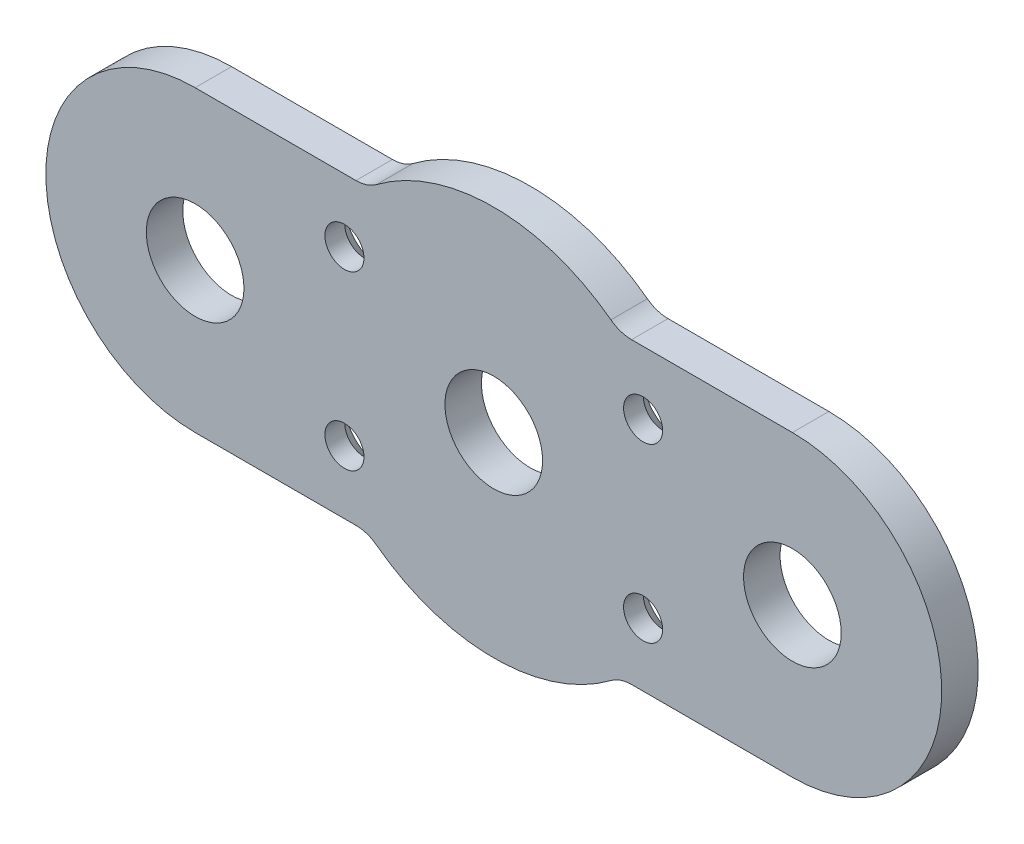
ISO-10303-21;
HEADER;
FILE_DESCRIPTION(('STEP AP214'),'2;1');
FILE_NAME('part.step','',(''),(''),'','','');
FILE_SCHEMA(('AUTOMOTIVE_DESIGN { 1 0 10303 214 1 1 1 1 }'));
ENDSEC;
DATA;
#1=APPLICATION_CONTEXT('core data for automotive mechanical design processes');
#2=APPLICATION_PROTOCOL_DEFINITION('international standard','automotive_design',2000,#1);
#3=PRODUCT_CONTEXT('',#1,'mechanical');
#4=PRODUCT('Part','Part','',(#3));
#5=PRODUCT_RELATED_PRODUCT_CATEGORY('part','',(#4));
#6=PRODUCT_DEFINITION_FORMATION('','',#4);
#7=PRODUCT_DEFINITION_CONTEXT('part definition',#1,'design');
#8=PRODUCT_DEFINITION('design','',#6,#7);
#9=PRODUCT_DEFINITION_SHAPE('','',#8);
#10=(LENGTH_UNIT() NAMED_UNIT(*) SI_UNIT(.MILLI.,.METRE.));
#11=(NAMED_UNIT(*) PLANE_ANGLE_UNIT() SI_UNIT($,.RADIAN.));
#12=(NAMED_UNIT(*) SI_UNIT($,.STERADIAN.) SOLID_ANGLE_UNIT());
#13=UNCERTAINTY_MEASURE_WITH_UNIT(LENGTH_MEASURE(1.E-05),#10,'distance_accuracy_value','');
#14=(GEOMETRIC_REPRESENTATION_CONTEXT(3) GLOBAL_UNCERTAINTY_ASSIGNED_CONTEXT((#13)) GLOBAL_UNIT_ASSIGNED_CONTEXT((#10,
#11,#12)) REPRESENTATION_CONTEXT('',''));
#15=CARTESIAN_POINT('',(0.,0.,0.));
#16=DIRECTION('',(0.,0.,1.));
#17=DIRECTION('',(1.,0.,0.));
#18=AXIS2_PLACEMENT_3D('',#15,#16,#17);
#19=CARTESIAN_POINT('',(13.,-7.5,79.9999999999841));
#20=DIRECTION('',(0.,0.,-1.));
#21=DIRECTION('',(-1.,0.,0.));
#22=AXIS2_PLACEMENT_3D('',#19,#20,#21);
#23=CONICAL_SURFACE('',#22,3.14999999997144,0.785398163397448);
#24=CARTESIAN_POINT('',(13.,-7.5,81.45));
#25=DIRECTION('',(0.,0.,1.));
#26=DIRECTION('',(1.,0.,0.));
#27=AXIS2_PLACEMENT_3D('',#24,#25,#26);
#28=CIRCLE('',#27,1.7);
#29=CARTESIAN_POINT('',(14.7,-7.5,81.45));
#30=VERTEX_POINT('',#29);
#31=EDGE_CURVE('E338',#30,#30,#28,.T.);
#32=ORIENTED_EDGE('',*,*,#31,.T.);
#33=EDGE_LOOP('',(#32));
#34=FACE_BOUND('',#33,.T.);
#35=CARTESIAN_POINT('',(13.,-7.5,79.9999999999673));
#36=DIRECTION('',(0.,0.,-1.));
#37=DIRECTION('',(-1.,0.,0.));
#38=AXIS2_PLACEMENT_3D('',#35,#36,#37);
#39=CIRCLE('',#38,3.14999999998827);
#40=CARTESIAN_POINT('',(9.85000000001173,-7.5,79.9999999999673));
#41=VERTEX_POINT('',#40);
#42=EDGE_CURVE('E20',#41,#41,#39,.F.);
#43=ORIENTED_EDGE('',*,*,#42,.F.);
#44=EDGE_LOOP('',(#43));
#45=FACE_BOUND('',#44,.T.);
#46=ADVANCED_FACE('F17',(#34,#45),#23,.F.);
#47=CARTESIAN_POINT('',(-13.,-7.5,79.9999999999272));
#48=DIRECTION('',(0.,0.,-1.));
#49=DIRECTION('',(-1.,0.,0.));
#50=AXIS2_PLACEMENT_3D('',#47,#48,#49);
#51=CONICAL_SURFACE('',#50,3.1499999999819,0.785398163377847);
#52=CARTESIAN_POINT('',(-13.,-7.5,81.45));
#53=DIRECTION('',(0.,0.,1.));
#54=DIRECTION('',(1.,0.,0.));
#55=AXIS2_PLACEMENT_3D('',#52,#53,#54);
#56=CIRCLE('',#55,1.7);
#57=CARTESIAN_POINT('',(-11.3,-7.5,81.45));
#58=VERTEX_POINT('',#57);
#59=EDGE_CURVE('E333',#58,#58,#56,.T.);
#60=ORIENTED_EDGE('',*,*,#59,.T.);
#61=EDGE_LOOP('',(#60));
#62=FACE_BOUND('',#61,.T.);
#63=CARTESIAN_POINT('',(-13.,-7.5,79.9999999999272));
#64=DIRECTION('',(0.,0.,-1.));
#65=DIRECTION('',(-1.,0.,0.));
#66=AXIS2_PLACEMENT_3D('',#63,#64,#65);
#67=CIRCLE('',#66,3.1499999999819);
#68=CARTESIAN_POINT('',(-16.1499999999819,-7.5,79.9999999999272));
#69=VERTEX_POINT('',#68);
#70=EDGE_CURVE('E217',#69,#69,#67,.F.);
#71=ORIENTED_EDGE('',*,*,#70,.F.);
#72=EDGE_LOOP('',(#71));
#73=FACE_BOUND('',#72,.T.);
#74=ADVANCED_FACE('F226',(#62,#73),#51,.F.);
#75=CARTESIAN_POINT('',(-13.,7.5,79.9999999999272));
#76=DIRECTION('',(0.,0.,-1.));
#77=DIRECTION('',(-1.,0.,0.));
#78=AXIS2_PLACEMENT_3D('',#75,#76,#77);
#79=CONICAL_SURFACE('',#78,3.1499999999819,0.785398163377847);
#80=CARTESIAN_POINT('',(-13.,7.5,81.45));
#81=DIRECTION('',(0.,0.,1.));
#82=DIRECTION('',(1.,0.,0.));
#83=AXIS2_PLACEMENT_3D('',#80,#81,#82);
#84=CIRCLE('',#83,1.7);
#85=CARTESIAN_POINT('',(-11.3,7.5,81.45));
#86=VERTEX_POINT('',#85);
#87=EDGE_CURVE('E329',#86,#86,#84,.T.);
#88=ORIENTED_EDGE('',*,*,#87,.T.);
#89=EDGE_LOOP('',(#88));
#90=FACE_BOUND('',#89,.T.);
#91=CARTESIAN_POINT('',(-13.,7.5,79.9999999999272));
#92=DIRECTION('',(0.,0.,-1.));
#93=DIRECTION('',(-1.,0.,0.));
#94=AXIS2_PLACEMENT_3D('',#91,#92,#93);
#95=CIRCLE('',#94,3.1499999999819);
#96=CARTESIAN_POINT('',(-16.1499999999819,7.5,79.9999999999272));
#97=VERTEX_POINT('',#96);
#98=EDGE_CURVE('E215',#97,#97,#95,.F.);
#99=ORIENTED_EDGE('',*,*,#98,.F.);
#100=EDGE_LOOP('',(#99));
#101=FACE_BOUND('',#100,.T.);
#102=ADVANCED_FACE('F232',(#90,#101),#79,.F.);
#103=CARTESIAN_POINT('',(13.,7.5,79.9999999999841));
#104=DIRECTION('',(0.,0.,-1.));
#105=DIRECTION('',(-1.,0.,0.));
#106=AXIS2_PLACEMENT_3D('',#103,#104,#105);
#107=CONICAL_SURFACE('',#106,3.14999999997144,0.785398163397448);
#108=CARTESIAN_POINT('',(13.,7.5,81.45));
#109=DIRECTION('',(0.,0.,1.));
#110=DIRECTION('',(1.,0.,0.));
#111=AXIS2_PLACEMENT_3D('',#108,#109,#110);
#112=CIRCLE('',#111,1.7);
#113=CARTESIAN_POINT('',(14.7,7.5,81.45));
#114=VERTEX_POINT('',#113);
#115=EDGE_CURVE('E197',#114,#114,#112,.T.);
#116=ORIENTED_EDGE('',*,*,#115,.T.);
#117=EDGE_LOOP('',(#116));
#118=FACE_BOUND('',#117,.T.);
#119=CARTESIAN_POINT('',(13.,7.5,79.9999999999673));
#120=DIRECTION('',(0.,0.,-1.));
#121=DIRECTION('',(-1.,0.,0.));
#122=AXIS2_PLACEMENT_3D('',#119,#120,#121);
#123=CIRCLE('',#122,3.14999999998827);
#124=CARTESIAN_POINT('',(9.85000000001173,7.5,79.9999999999673));
#125=VERTEX_POINT('',#124);
#126=EDGE_CURVE('E135',#125,#125,#123,.F.);
#127=ORIENTED_EDGE('',*,*,#126,.F.);
#128=EDGE_LOOP('',(#127));
#129=FACE_BOUND('',#128,.T.);
#130=ADVANCED_FACE('F317',(#118,#129),#107,.F.);
#131=CARTESIAN_POINT('',(0.,0.,80.));
#132=DIRECTION('',(0.,0.,-1.));
#133=DIRECTION('',(-1.,0.,0.));
#134=AXIS2_PLACEMENT_3D('',#131,#132,#133);
#135=PLANE('',#134);
#136=CARTESIAN_POINT('',(26.,0.,80.));
#137=DIRECTION('',(0.,0.,1.));
#138=DIRECTION('',(1.,0.,0.));
#139=AXIS2_PLACEMENT_3D('',#136,#137,#138);
#140=CIRCLE('',#139,4.25);
#141=CARTESIAN_POINT('',(30.25,0.,80.));
#142=VERTEX_POINT('',#141);
#143=EDGE_CURVE('E188',#142,#142,#140,.T.);
#144=ORIENTED_EDGE('',*,*,#143,.T.);
#145=EDGE_LOOP('',(#144));
#146=FACE_BOUND('',#145,.T.);
#147=CARTESIAN_POINT('',(-26.,0.,80.));
#148=DIRECTION('',(0.,0.,1.));
#149=DIRECTION('',(1.,0.,0.));
#150=AXIS2_PLACEMENT_3D('',#147,#148,#149);
#151=CIRCLE('',#150,4.25);
#152=CARTESIAN_POINT('',(-21.75,0.,80.));
#153=VERTEX_POINT('',#152);
#154=EDGE_CURVE('E191',#153,#153,#151,.T.);
#155=ORIENTED_EDGE('',*,*,#154,.T.);
#156=EDGE_LOOP('',(#155));
#157=FACE_BOUND('',#156,.T.);
#158=CARTESIAN_POINT('',(0.,0.,80.));
#159=DIRECTION('',(0.,0.,1.));
#160=DIRECTION('',(1.,0.,0.));
#161=AXIS2_PLACEMENT_3D('',#158,#159,#160);
#162=CIRCLE('',#161,4.25);
#163=CARTESIAN_POINT('',(4.25,0.,80.));
#164=VERTEX_POINT('',#163);
#165=EDGE_CURVE('E194',#164,#164,#162,.T.);
#166=ORIENTED_EDGE('',*,*,#165,.T.);
#167=EDGE_LOOP('',(#166));
#168=FACE_BOUND('',#167,.T.);
#169=ORIENTED_EDGE('',*,*,#126,.T.);
#170=EDGE_LOOP('',(#169));
#171=FACE_BOUND('',#170,.T.);
#172=ORIENTED_EDGE('',*,*,#98,.T.);
#173=EDGE_LOOP('',(#172));
#174=FACE_BOUND('',#173,.T.);
#175=ORIENTED_EDGE('',*,*,#70,.T.);
#176=EDGE_LOOP('',(#175));
#177=FACE_BOUND('',#176,.T.);
#178=ORIENTED_EDGE('',*,*,#42,.T.);
#179=EDGE_LOOP('',(#178));
#180=FACE_BOUND('',#179,.T.);
#181=CARTESIAN_POINT('',(0.,0.,80.));
#182=DIRECTION('',(0.,0.,-1.));
#183=DIRECTION('',(-1.,0.,0.));
#184=AXIS2_PLACEMENT_3D('',#181,#182,#183);
#185=CIRCLE('',#184,17.);
#186=CARTESIAN_POINT('',(-10.2,-13.6,80.));
#187=VERTEX_POINT('',#186);
#188=CARTESIAN_POINT('',(10.1999999999999,-13.6,80.));
#189=VERTEX_POINT('',#188);
#190=EDGE_CURVE('E203',#187,#189,#185,.F.);
#191=ORIENTED_EDGE('',*,*,#190,.F.);
#192=CARTESIAN_POINT('',(-12.,-16.,80.));
#193=DIRECTION('',(0.,0.,-1.));
#194=DIRECTION('',(-1.,0.,0.));
#195=AXIS2_PLACEMENT_3D('',#192,#193,#194);
#196=CIRCLE('',#195,3.);
#197=CARTESIAN_POINT('',(-12.,-13.,80.));
#198=VERTEX_POINT('',#197);
#199=EDGE_CURVE('E139',#187,#198,#196,.F.);
#200=ORIENTED_EDGE('',*,*,#199,.T.);
#201=DIRECTION('',(1.,0.,0.));
#202=VECTOR('',#201,1.);
#203=CARTESIAN_POINT('',(-12.,-13.,80.));
#204=LINE('',#203,#202);
#205=CARTESIAN_POINT('',(-26.,-13.,80.));
#206=VERTEX_POINT('',#205);
#207=EDGE_CURVE('E136',#206,#198,#204,.T.);
#208=ORIENTED_EDGE('',*,*,#207,.F.);
#209=CARTESIAN_POINT('',(-26.,0.,80.));
#210=DIRECTION('',(0.,0.,-1.));
#211=DIRECTION('',(-1.,0.,0.));
#212=AXIS2_PLACEMENT_3D('',#209,#210,#211);
#213=CIRCLE('',#212,13.);
#214=CARTESIAN_POINT('',(-26.,13.,80.));
#215=VERTEX_POINT('',#214);
#216=EDGE_CURVE('E198',#215,#206,#213,.F.);
#217=ORIENTED_EDGE('',*,*,#216,.F.);
#218=DIRECTION('',(1.,0.,0.));
#219=VECTOR('',#218,1.);
#220=CARTESIAN_POINT('',(-26.,13.,80.));
#221=LINE('',#220,#219);
#222=CARTESIAN_POINT('',(-12.,13.,80.));
#223=VERTEX_POINT('',#222);
#224=EDGE_CURVE('E103',#223,#215,#221,.F.);
#225=ORIENTED_EDGE('',*,*,#224,.F.);
#226=CARTESIAN_POINT('',(-12.,16.,80.));
#227=DIRECTION('',(0.,0.,-1.));
#228=DIRECTION('',(-1.,0.,0.));
#229=AXIS2_PLACEMENT_3D('',#226,#227,#228);
#230=CIRCLE('',#229,3.);
#231=CARTESIAN_POINT('',(-10.2,13.6,80.));
#232=VERTEX_POINT('',#231);
#233=EDGE_CURVE('E117',#223,#232,#230,.F.);
#234=ORIENTED_EDGE('',*,*,#233,.T.);
#235=CARTESIAN_POINT('',(0.,0.,80.));
#236=DIRECTION('',(0.,0.,-1.));
#237=DIRECTION('',(-1.,0.,0.));
#238=AXIS2_PLACEMENT_3D('',#235,#236,#237);
#239=CIRCLE('',#238,17.);
#240=CARTESIAN_POINT('',(10.1999999999999,13.6,80.));
#241=VERTEX_POINT('',#240);
#242=EDGE_CURVE('E108',#241,#232,#239,.F.);
#243=ORIENTED_EDGE('',*,*,#242,.F.);
#244=CARTESIAN_POINT('',(11.9999999999999,16.,80.));
#245=DIRECTION('',(0.,0.,-1.));
#246=DIRECTION('',(-1.,0.,0.));
#247=AXIS2_PLACEMENT_3D('',#244,#245,#246);
#248=CIRCLE('',#247,3.);
#249=CARTESIAN_POINT('',(11.9999999999999,13.,80.));
#250=VERTEX_POINT('',#249);
#251=EDGE_CURVE('E129',#241,#250,#248,.F.);
#252=ORIENTED_EDGE('',*,*,#251,.T.);
#253=DIRECTION('',(-1.,0.,0.));
#254=VECTOR('',#253,1.);
#255=CARTESIAN_POINT('',(11.9999999999999,13.,80.));
#256=LINE('',#255,#254);
#257=CARTESIAN_POINT('',(26.,13.,80.));
#258=VERTEX_POINT('',#257);
#259=EDGE_CURVE('E144',#258,#250,#256,.T.);
#260=ORIENTED_EDGE('',*,*,#259,.F.);
#261=CARTESIAN_POINT('',(26.,0.,80.));
#262=DIRECTION('',(0.,0.,-1.));
#263=DIRECTION('',(-1.,0.,0.));
#264=AXIS2_PLACEMENT_3D('',#261,#262,#263);
#265=CIRCLE('',#264,13.);
#266=CARTESIAN_POINT('',(26.,-13.,80.));
#267=VERTEX_POINT('',#266);
#268=EDGE_CURVE('E210',#267,#258,#265,.F.);
#269=ORIENTED_EDGE('',*,*,#268,.F.);
#270=DIRECTION('',(1.,0.,0.));
#271=VECTOR('',#270,1.);
#272=CARTESIAN_POINT('',(26.,-13.,80.));
#273=LINE('',#272,#271);
#274=CARTESIAN_POINT('',(11.9999999999999,-13.,80.));
#275=VERTEX_POINT('',#274);
#276=EDGE_CURVE('E140',#275,#267,#273,.T.);
#277=ORIENTED_EDGE('',*,*,#276,.F.);
#278=CARTESIAN_POINT('',(11.9999999999999,-16.,80.));
#279=DIRECTION('',(0.,0.,-1.));
#280=DIRECTION('',(-1.,0.,0.));
#281=AXIS2_PLACEMENT_3D('',#278,#279,#280);
#282=CIRCLE('',#281,3.);
#283=EDGE_CURVE('E206',#275,#189,#282,.F.);
#284=ORIENTED_EDGE('',*,*,#283,.T.);
#285=EDGE_LOOP('',(#191,#200,#208,#217,#225,#234,#243,#252,#260,#269,#277,#284));
#286=FACE_BOUND('',#285,.T.);
#287=ADVANCED_FACE('F119',(#146,#157,#168,#171,#174,#177,#180,#286),#135,.T.);
#288=CARTESIAN_POINT('',(-26.,13.,83.175));
#289=DIRECTION('',(0.,1.,0.));
#290=DIRECTION('',(0.,0.,1.));
#291=AXIS2_PLACEMENT_3D('',#288,#289,#290);
#292=PLANE('',#291);
#293=DIRECTION('',(-1.,0.,0.));
#294=VECTOR('',#293,1.);
#295=CARTESIAN_POINT('',(0.,13.,83.175));
#296=LINE('',#295,#294);
#297=CARTESIAN_POINT('',(-26.,13.,83.175));
#298=VERTEX_POINT('',#297);
#299=CARTESIAN_POINT('',(-12.,13.,83.175));
#300=VERTEX_POINT('',#299);
#301=EDGE_CURVE('E187',#298,#300,#296,.F.);
#302=ORIENTED_EDGE('',*,*,#301,.T.);
#303=DIRECTION('',(0.,0.,-1.));
#304=VECTOR('',#303,1.);
#305=CARTESIAN_POINT('',(-12.,13.,83.175));
#306=LINE('',#305,#304);
#307=EDGE_CURVE('E122',#300,#223,#306,.T.);
#308=ORIENTED_EDGE('',*,*,#307,.T.);
#309=ORIENTED_EDGE('',*,*,#224,.T.);
#310=DIRECTION('',(0.,0.,-1.));
#311=VECTOR('',#310,1.);
#312=CARTESIAN_POINT('',(-26.,13.,83.175));
#313=LINE('',#312,#311);
#314=EDGE_CURVE('E348',#298,#215,#313,.T.);
#315=ORIENTED_EDGE('',*,*,#314,.F.);
#316=EDGE_LOOP('',(#302,#308,#309,#315));
#317=FACE_BOUND('',#316,.T.);
#318=ADVANCED_FACE('F311',(#317),#292,.T.);
#319=CARTESIAN_POINT('',(-12.,16.,83.175));
#320=DIRECTION('',(0.,0.,-1.));
#321=DIRECTION('',(-1.,0.,0.));
#322=AXIS2_PLACEMENT_3D('',#319,#320,#321);
#323=CYLINDRICAL_SURFACE('',#322,3.);
#324=ORIENTED_EDGE('',*,*,#307,.F.);
#325=CARTESIAN_POINT('',(-12.,16.,83.175));
#326=DIRECTION('',(0.,0.,-1.));
#327=DIRECTION('',(-1.,0.,0.));
#328=AXIS2_PLACEMENT_3D('',#325,#326,#327);
#329=CIRCLE('',#328,3.);
#330=CARTESIAN_POINT('',(-10.2,13.6,83.175));
#331=VERTEX_POINT('',#330);
#332=EDGE_CURVE('E127',#300,#331,#329,.F.);
#333=ORIENTED_EDGE('',*,*,#332,.T.);
#334=DIRECTION('',(0.,0.,-1.));
#335=VECTOR('',#334,1.);
#336=CARTESIAN_POINT('',(-10.2,13.6,83.175));
#337=LINE('',#336,#335);
#338=EDGE_CURVE('E112',#232,#331,#337,.F.);
#339=ORIENTED_EDGE('',*,*,#338,.F.);
#340=ORIENTED_EDGE('',*,*,#233,.F.);
#341=EDGE_LOOP('',(#324,#333,#339,#340));
#342=FACE_BOUND('',#341,.T.);
#343=ADVANCED_FACE('F125',(#342),#323,.F.);
#344=CARTESIAN_POINT('',(0.,0.,83.175));
#345=DIRECTION('',(0.,0.,-1.));
#346=DIRECTION('',(-1.,0.,0.));
#347=AXIS2_PLACEMENT_3D('',#344,#345,#346);
#348=CYLINDRICAL_SURFACE('',#347,17.);
#349=CARTESIAN_POINT('',(0.,0.,83.175));
#350=DIRECTION('',(0.,0.,-1.));
#351=DIRECTION('',(-1.,0.,0.));
#352=AXIS2_PLACEMENT_3D('',#349,#350,#351);
#353=CIRCLE('',#352,17.);
#354=CARTESIAN_POINT('',(10.1999999999999,13.6,83.175));
#355=VERTEX_POINT('',#354);
#356=EDGE_CURVE('E184',#331,#355,#353,.T.);
#357=ORIENTED_EDGE('',*,*,#356,.T.);
#358=DIRECTION('',(0.,0.,-1.));
#359=VECTOR('',#358,1.);
#360=CARTESIAN_POINT('',(10.1999999999999,13.6,83.175));
#361=LINE('',#360,#359);
#362=EDGE_CURVE('E114',#355,#241,#361,.T.);
#363=ORIENTED_EDGE('',*,*,#362,.T.);
#364=ORIENTED_EDGE('',*,*,#242,.T.);
#365=ORIENTED_EDGE('',*,*,#338,.T.);
#366=EDGE_LOOP('',(#357,#363,#364,#365));
#367=FACE_BOUND('',#366,.T.);
#368=ADVANCED_FACE('F110',(#367),#348,.T.);
#369=CARTESIAN_POINT('',(11.9999999999999,16.,83.175));
#370=DIRECTION('',(0.,0.,-1.));
#371=DIRECTION('',(-1.,0.,0.));
#372=AXIS2_PLACEMENT_3D('',#369,#370,#371);
#373=CYLINDRICAL_SURFACE('',#372,3.);
#374=ORIENTED_EDGE('',*,*,#362,.F.);
#375=CARTESIAN_POINT('',(11.9999999999999,16.,83.175));
#376=DIRECTION('',(0.,0.,-1.));
#377=DIRECTION('',(-1.,0.,0.));
#378=AXIS2_PLACEMENT_3D('',#375,#376,#377);
#379=CIRCLE('',#378,3.);
#380=CARTESIAN_POINT('',(11.9999999999999,13.,83.175));
#381=VERTEX_POINT('',#380);
#382=EDGE_CURVE('E181',#355,#381,#379,.F.);
#383=ORIENTED_EDGE('',*,*,#382,.T.);
#384=DIRECTION('',(0.,0.,1.));
#385=VECTOR('',#384,1.);
#386=CARTESIAN_POINT('',(11.9999999999999,13.,83.175));
#387=LINE('',#386,#385);
#388=EDGE_CURVE('E145',#250,#381,#387,.T.);
#389=ORIENTED_EDGE('',*,*,#388,.F.);
#390=ORIENTED_EDGE('',*,*,#251,.F.);
#391=EDGE_LOOP('',(#374,#383,#389,#390));
#392=FACE_BOUND('',#391,.T.);
#393=ADVANCED_FACE('F302',(#392),#373,.F.);
#394=CARTESIAN_POINT('',(11.9999999999999,13.,83.175));
#395=DIRECTION('',(0.,1.,0.));
#396=DIRECTION('',(-1.,0.,0.));
#397=AXIS2_PLACEMENT_3D('',#394,#395,#396);
#398=PLANE('',#397);
#399=DIRECTION('',(-1.,0.,0.));
#400=VECTOR('',#399,1.);
#401=CARTESIAN_POINT('',(0.,13.,83.175));
#402=LINE('',#401,#400);
#403=CARTESIAN_POINT('',(26.,13.,83.175));
#404=VERTEX_POINT('',#403);
#405=EDGE_CURVE('E180',#381,#404,#402,.F.);
#406=ORIENTED_EDGE('',*,*,#405,.T.);
#407=DIRECTION('',(0.,0.,-1.));
#408=VECTOR('',#407,1.);
#409=CARTESIAN_POINT('',(26.,13.,83.175));
#410=LINE('',#409,#408);
#411=EDGE_CURVE('E143',#258,#404,#410,.F.);
#412=ORIENTED_EDGE('',*,*,#411,.F.);
#413=ORIENTED_EDGE('',*,*,#259,.T.);
#414=ORIENTED_EDGE('',*,*,#388,.T.);
#415=EDGE_LOOP('',(#406,#412,#413,#414));
#416=FACE_BOUND('',#415,.T.);
#417=ADVANCED_FACE('F298',(#416),#398,.T.);
#418=CARTESIAN_POINT('',(26.,0.,83.175));
#419=DIRECTION('',(0.,0.,-1.));
#420=DIRECTION('',(-1.,0.,0.));
#421=AXIS2_PLACEMENT_3D('',#418,#419,#420);
#422=CYLINDRICAL_SURFACE('',#421,13.);
#423=CARTESIAN_POINT('',(26.,0.,83.175));
#424=DIRECTION('',(0.,0.,-1.));
#425=DIRECTION('',(-1.,0.,0.));
#426=AXIS2_PLACEMENT_3D('',#423,#424,#425);
#427=CIRCLE('',#426,13.);
#428=CARTESIAN_POINT('',(26.,-13.,83.175));
#429=VERTEX_POINT('',#428);
#430=EDGE_CURVE('E177',#404,#429,#427,.T.);
#431=ORIENTED_EDGE('',*,*,#430,.T.);
#432=DIRECTION('',(0.,0.,-1.));
#433=VECTOR('',#432,1.);
#434=CARTESIAN_POINT('',(26.,-13.,83.175));
#435=LINE('',#434,#433);
#436=EDGE_CURVE('E142',#267,#429,#435,.F.);
#437=ORIENTED_EDGE('',*,*,#436,.F.);
#438=ORIENTED_EDGE('',*,*,#268,.T.);
#439=ORIENTED_EDGE('',*,*,#411,.T.);
#440=EDGE_LOOP('',(#431,#437,#438,#439));
#441=FACE_BOUND('',#440,.T.);
#442=ADVANCED_FACE('F294',(#441),#422,.T.);
#443=CARTESIAN_POINT('',(26.,-13.,83.175));
#444=DIRECTION('',(0.,-1.,0.));
#445=DIRECTION('',(0.,0.,-1.));
#446=AXIS2_PLACEMENT_3D('',#443,#444,#445);
#447=PLANE('',#446);
#448=DIRECTION('',(-1.,0.,0.));
#449=VECTOR('',#448,1.);
#450=CARTESIAN_POINT('',(0.,-13.,83.175));
#451=LINE('',#450,#449);
#452=CARTESIAN_POINT('',(11.9999999999999,-13.,83.175));
#453=VERTEX_POINT('',#452);
#454=EDGE_CURVE('E176',#429,#453,#451,.T.);
#455=ORIENTED_EDGE('',*,*,#454,.T.);
#456=DIRECTION('',(0.,0.,-1.));
#457=VECTOR('',#456,1.);
#458=CARTESIAN_POINT('',(11.9999999999999,-13.,83.175));
#459=LINE('',#458,#457);
#460=EDGE_CURVE('E209',#453,#275,#459,.T.);
#461=ORIENTED_EDGE('',*,*,#460,.T.);
#462=ORIENTED_EDGE('',*,*,#276,.T.);
#463=ORIENTED_EDGE('',*,*,#436,.T.);
#464=EDGE_LOOP('',(#455,#461,#462,#463));
#465=FACE_BOUND('',#464,.T.);
#466=ADVANCED_FACE('F290',(#465),#447,.T.);
#467=CARTESIAN_POINT('',(11.9999999999999,-16.,83.175));
#468=DIRECTION('',(0.,0.,-1.));
#469=DIRECTION('',(-1.,0.,0.));
#470=AXIS2_PLACEMENT_3D('',#467,#468,#469);
#471=CYLINDRICAL_SURFACE('',#470,3.);
#472=ORIENTED_EDGE('',*,*,#460,.F.);
#473=CARTESIAN_POINT('',(11.9999999999999,-16.,83.175));
#474=DIRECTION('',(0.,0.,-1.));
#475=DIRECTION('',(-1.,0.,0.));
#476=AXIS2_PLACEMENT_3D('',#473,#474,#475);
#477=CIRCLE('',#476,3.);
#478=CARTESIAN_POINT('',(10.1999999999999,-13.6,83.175));
#479=VERTEX_POINT('',#478);
#480=EDGE_CURVE('E173',#453,#479,#477,.F.);
#481=ORIENTED_EDGE('',*,*,#480,.T.);
#482=DIRECTION('',(0.,0.,-1.));
#483=VECTOR('',#482,1.);
#484=CARTESIAN_POINT('',(10.1999999999999,-13.6,83.175));
#485=LINE('',#484,#483);
#486=EDGE_CURVE('E205',#189,#479,#485,.F.);
#487=ORIENTED_EDGE('',*,*,#486,.F.);
#488=ORIENTED_EDGE('',*,*,#283,.F.);
#489=EDGE_LOOP('',(#472,#481,#487,#488));
#490=FACE_BOUND('',#489,.T.);
#491=ADVANCED_FACE('F286',(#490),#471,.F.);
#492=CARTESIAN_POINT('',(0.,0.,83.175));
#493=DIRECTION('',(0.,0.,-1.));
#494=DIRECTION('',(-1.,0.,0.));
#495=AXIS2_PLACEMENT_3D('',#492,#493,#494);
#496=CYLINDRICAL_SURFACE('',#495,17.);
#497=CARTESIAN_POINT('',(0.,0.,83.175));
#498=DIRECTION('',(0.,0.,-1.));
#499=DIRECTION('',(-1.,0.,0.));
#500=AXIS2_PLACEMENT_3D('',#497,#498,#499);
#501=CIRCLE('',#500,17.);
#502=CARTESIAN_POINT('',(-10.2,-13.6,83.175));
#503=VERTEX_POINT('',#502);
#504=EDGE_CURVE('E170',#479,#503,#501,.T.);
#505=ORIENTED_EDGE('',*,*,#504,.T.);
#506=DIRECTION('',(0.,0.,-1.));
#507=VECTOR('',#506,1.);
#508=CARTESIAN_POINT('',(-10.2,-13.6,83.175));
#509=LINE('',#508,#507);
#510=EDGE_CURVE('E202',#503,#187,#509,.T.);
#511=ORIENTED_EDGE('',*,*,#510,.T.);
#512=ORIENTED_EDGE('',*,*,#190,.T.);
#513=ORIENTED_EDGE('',*,*,#486,.T.);
#514=EDGE_LOOP('',(#505,#511,#512,#513));
#515=FACE_BOUND('',#514,.T.);
#516=ADVANCED_FACE('F282',(#515),#496,.T.);
#517=CARTESIAN_POINT('',(-12.,-16.,83.175));
#518=DIRECTION('',(0.,0.,-1.));
#519=DIRECTION('',(-1.,0.,0.));
#520=AXIS2_PLACEMENT_3D('',#517,#518,#519);
#521=CYLINDRICAL_SURFACE('',#520,3.);
#522=ORIENTED_EDGE('',*,*,#510,.F.);
#523=CARTESIAN_POINT('',(-12.,-16.,83.175));
#524=DIRECTION('',(0.,0.,-1.));
#525=DIRECTION('',(-1.,0.,0.));
#526=AXIS2_PLACEMENT_3D('',#523,#524,#525);
#527=CIRCLE('',#526,3.);
#528=CARTESIAN_POINT('',(-12.,-13.,83.175));
#529=VERTEX_POINT('',#528);
#530=EDGE_CURVE('E167',#503,#529,#527,.F.);
#531=ORIENTED_EDGE('',*,*,#530,.T.);
#532=DIRECTION('',(0.,0.,-1.));
#533=VECTOR('',#532,1.);
#534=CARTESIAN_POINT('',(-12.,-13.,83.175));
#535=LINE('',#534,#533);
#536=EDGE_CURVE('E138',#198,#529,#535,.F.);
#537=ORIENTED_EDGE('',*,*,#536,.F.);
#538=ORIENTED_EDGE('',*,*,#199,.F.);
#539=EDGE_LOOP('',(#522,#531,#537,#538));
#540=FACE_BOUND('',#539,.T.);
#541=ADVANCED_FACE('F278',(#540),#521,.F.);
#542=CARTESIAN_POINT('',(-12.,-13.,83.175));
#543=DIRECTION('',(0.,-1.,0.));
#544=DIRECTION('',(0.,0.,-1.));
#545=AXIS2_PLACEMENT_3D('',#542,#543,#544);
#546=PLANE('',#545);
#547=DIRECTION('',(-1.,0.,0.));
#548=VECTOR('',#547,1.);
#549=CARTESIAN_POINT('',(0.,-13.,83.175));
#550=LINE('',#549,#548);
#551=CARTESIAN_POINT('',(-26.,-13.,83.175));
#552=VERTEX_POINT('',#551);
#553=EDGE_CURVE('E166',#529,#552,#550,.T.);
#554=ORIENTED_EDGE('',*,*,#553,.T.);
#555=DIRECTION('',(0.,0.,-1.));
#556=VECTOR('',#555,1.);
#557=CARTESIAN_POINT('',(-26.,-13.,83.175));
#558=LINE('',#557,#556);
#559=EDGE_CURVE('E35',#206,#552,#558,.F.);
#560=ORIENTED_EDGE('',*,*,#559,.F.);
#561=ORIENTED_EDGE('',*,*,#207,.T.);
#562=ORIENTED_EDGE('',*,*,#536,.T.);
#563=EDGE_LOOP('',(#554,#560,#561,#562));
#564=FACE_BOUND('',#563,.T.);
#565=ADVANCED_FACE('F275',(#564),#546,.T.);
#566=CARTESIAN_POINT('',(-26.,0.,83.175));
#567=DIRECTION('',(0.,0.,-1.));
#568=DIRECTION('',(-1.,0.,0.));
#569=AXIS2_PLACEMENT_3D('',#566,#567,#568);
#570=CYLINDRICAL_SURFACE('',#569,13.);
#571=CARTESIAN_POINT('',(-26.,0.,83.175));
#572=DIRECTION('',(0.,0.,-1.));
#573=DIRECTION('',(-1.,0.,0.));
#574=AXIS2_PLACEMENT_3D('',#571,#572,#573);
#575=CIRCLE('',#574,13.);
#576=EDGE_CURVE('E164',#552,#298,#575,.T.);
#577=ORIENTED_EDGE('',*,*,#576,.T.);
#578=ORIENTED_EDGE('',*,*,#314,.T.);
#579=ORIENTED_EDGE('',*,*,#216,.T.);
#580=ORIENTED_EDGE('',*,*,#559,.T.);
#581=EDGE_LOOP('',(#577,#578,#579,#580));
#582=FACE_BOUND('',#581,.T.);
#583=ADVANCED_FACE('F271',(#582),#570,.T.);
#584=CARTESIAN_POINT('',(13.,-7.5,88.));
#585=DIRECTION('',(0.,0.,1.));
#586=DIRECTION('',(1.,0.,0.));
#587=AXIS2_PLACEMENT_3D('',#584,#585,#586);
#588=CYLINDRICAL_SURFACE('',#587,1.7);
#589=CARTESIAN_POINT('',(13.,-7.5,83.175));
#590=DIRECTION('',(0.,0.,1.));
#591=DIRECTION('',(1.,0.,0.));
#592=AXIS2_PLACEMENT_3D('',#589,#590,#591);
#593=CIRCLE('',#592,1.7);
#594=CARTESIAN_POINT('',(14.7,-7.5,83.175));
#595=VERTEX_POINT('',#594);
#596=EDGE_CURVE('E161',#595,#595,#593,.T.);
#597=ORIENTED_EDGE('',*,*,#596,.T.);
#598=EDGE_LOOP('',(#597));
#599=FACE_BOUND('',#598,.T.);
#600=ORIENTED_EDGE('',*,*,#31,.F.);
#601=EDGE_LOOP('',(#600));
#602=FACE_BOUND('',#601,.T.);
#603=ADVANCED_FACE('F267',(#599,#602),#588,.F.);
#604=CARTESIAN_POINT('',(-13.,-7.5,88.));
#605=DIRECTION('',(0.,0.,1.));
#606=DIRECTION('',(1.,0.,0.));
#607=AXIS2_PLACEMENT_3D('',#604,#605,#606);
#608=CYLINDRICAL_SURFACE('',#607,1.7);
#609=CARTESIAN_POINT('',(-13.,-7.5,83.175));
#610=DIRECTION('',(0.,0.,1.));
#611=DIRECTION('',(1.,0.,0.));
#612=AXIS2_PLACEMENT_3D('',#609,#610,#611);
#613=CIRCLE('',#612,1.7);
#614=CARTESIAN_POINT('',(-11.3,-7.5,83.175));
#615=VERTEX_POINT('',#614);
#616=EDGE_CURVE('E158',#615,#615,#613,.T.);
#617=ORIENTED_EDGE('',*,*,#616,.T.);
#618=EDGE_LOOP('',(#617));
#619=FACE_BOUND('',#618,.T.);
#620=ORIENTED_EDGE('',*,*,#59,.F.);
#621=EDGE_LOOP('',(#620));
#622=FACE_BOUND('',#621,.T.);
#623=ADVANCED_FACE('F263',(#619,#622),#608,.F.);
#624=CARTESIAN_POINT('',(-13.,7.5,88.));
#625=DIRECTION('',(0.,0.,1.));
#626=DIRECTION('',(1.,0.,0.));
#627=AXIS2_PLACEMENT_3D('',#624,#625,#626);
#628=CYLINDRICAL_SURFACE('',#627,1.7);
#629=CARTESIAN_POINT('',(-13.,7.5,83.175));
#630=DIRECTION('',(0.,0.,1.));
#631=DIRECTION('',(1.,0.,0.));
#632=AXIS2_PLACEMENT_3D('',#629,#630,#631);
#633=CIRCLE('',#632,1.7);
#634=CARTESIAN_POINT('',(-11.3,7.5,83.175));
#635=VERTEX_POINT('',#634);
#636=EDGE_CURVE('E155',#635,#635,#633,.T.);
#637=ORIENTED_EDGE('',*,*,#636,.T.);
#638=EDGE_LOOP('',(#637));
#639=FACE_BOUND('',#638,.T.);
#640=ORIENTED_EDGE('',*,*,#87,.F.);
#641=EDGE_LOOP('',(#640));
#642=FACE_BOUND('',#641,.T.);
#643=ADVANCED_FACE('F259',(#639,#642),#628,.F.);
#644=CARTESIAN_POINT('',(13.,7.5,88.));
#645=DIRECTION('',(0.,0.,1.));
#646=DIRECTION('',(1.,0.,0.));
#647=AXIS2_PLACEMENT_3D('',#644,#645,#646);
#648=CYLINDRICAL_SURFACE('',#647,1.7);
#649=CARTESIAN_POINT('',(13.,7.5,83.175));
#650=DIRECTION('',(0.,0.,1.));
#651=DIRECTION('',(1.,0.,0.));
#652=AXIS2_PLACEMENT_3D('',#649,#650,#651);
#653=CIRCLE('',#652,1.7);
#654=CARTESIAN_POINT('',(14.7,7.5,83.175));
#655=VERTEX_POINT('',#654);
#656=EDGE_CURVE('E152',#655,#655,#653,.T.);
#657=ORIENTED_EDGE('',*,*,#656,.T.);
#658=EDGE_LOOP('',(#657));
#659=FACE_BOUND('',#658,.T.);
#660=ORIENTED_EDGE('',*,*,#115,.F.);
#661=EDGE_LOOP('',(#660));
#662=FACE_BOUND('',#661,.T.);
#663=ADVANCED_FACE('F255',(#659,#662),#648,.F.);
#664=CARTESIAN_POINT('',(0.,0.,92.7462499999999));
#665=DIRECTION('',(0.,0.,1.));
#666=DIRECTION('',(1.,0.,0.));
#667=AXIS2_PLACEMENT_3D('',#664,#665,#666);
#668=CYLINDRICAL_SURFACE('',#667,4.25);
#669=CARTESIAN_POINT('',(0.,0.,83.175));
#670=DIRECTION('',(0.,0.,1.));
#671=DIRECTION('',(1.,0.,0.));
#672=AXIS2_PLACEMENT_3D('',#669,#670,#671);
#673=CIRCLE('',#672,4.25);
#674=CARTESIAN_POINT('',(4.25,0.,83.175));
#675=VERTEX_POINT('',#674);
#676=EDGE_CURVE('E149',#675,#675,#673,.T.);
#677=ORIENTED_EDGE('',*,*,#676,.T.);
#678=EDGE_LOOP('',(#677));
#679=FACE_BOUND('',#678,.T.);
#680=ORIENTED_EDGE('',*,*,#165,.F.);
#681=EDGE_LOOP('',(#680));
#682=FACE_BOUND('',#681,.T.);
#683=ADVANCED_FACE('F251',(#679,#682),#668,.F.);
#684=CARTESIAN_POINT('',(-26.,0.,92.7462499999999));
#685=DIRECTION('',(0.,0.,1.));
#686=DIRECTION('',(1.,0.,0.));
#687=AXIS2_PLACEMENT_3D('',#684,#685,#686);
#688=CYLINDRICAL_SURFACE('',#687,4.25);
#689=CARTESIAN_POINT('',(-26.,0.,83.175));
#690=DIRECTION('',(0.,0.,1.));
#691=DIRECTION('',(1.,0.,0.));
#692=AXIS2_PLACEMENT_3D('',#689,#690,#691);
#693=CIRCLE('',#692,4.25);
#694=CARTESIAN_POINT('',(-21.75,0.,83.175));
#695=VERTEX_POINT('',#694);
#696=EDGE_CURVE('E26',#695,#695,#693,.T.);
#697=ORIENTED_EDGE('',*,*,#696,.T.);
#698=EDGE_LOOP('',(#697));
#699=FACE_BOUND('',#698,.T.);
#700=ORIENTED_EDGE('',*,*,#154,.F.);
#701=EDGE_LOOP('',(#700));
#702=FACE_BOUND('',#701,.T.);
#703=ADVANCED_FACE('F243',(#699,#702),#688,.F.);
#704=CARTESIAN_POINT('',(26.,0.,92.7462499999999));
#705=DIRECTION('',(0.,0.,1.));
#706=DIRECTION('',(1.,0.,0.));
#707=AXIS2_PLACEMENT_3D('',#704,#705,#706);
#708=CYLINDRICAL_SURFACE('',#707,4.25);
#709=CARTESIAN_POINT('',(26.,0.,83.175));
#710=DIRECTION('',(0.,0.,1.));
#711=DIRECTION('',(1.,0.,0.));
#712=AXIS2_PLACEMENT_3D('',#709,#710,#711);
#713=CIRCLE('',#712,4.25);
#714=CARTESIAN_POINT('',(30.25,0.,83.175));
#715=VERTEX_POINT('',#714);
#716=EDGE_CURVE('E11',#715,#715,#713,.T.);
#717=ORIENTED_EDGE('',*,*,#716,.T.);
#718=EDGE_LOOP('',(#717));
#719=FACE_BOUND('',#718,.T.);
#720=ORIENTED_EDGE('',*,*,#143,.F.);
#721=EDGE_LOOP('',(#720));
#722=FACE_BOUND('',#721,.T.);
#723=ADVANCED_FACE('F237',(#719,#722),#708,.F.);
#724=CARTESIAN_POINT('',(0.,0.,83.175));
#725=DIRECTION('',(0.,0.,-1.));
#726=DIRECTION('',(-1.,0.,0.));
#727=AXIS2_PLACEMENT_3D('',#724,#725,#726);
#728=PLANE('',#727);
#729=ORIENTED_EDGE('',*,*,#716,.F.);
#730=EDGE_LOOP('',(#729));
#731=FACE_BOUND('',#730,.T.);
#732=ORIENTED_EDGE('',*,*,#696,.F.);
#733=EDGE_LOOP('',(#732));
#734=FACE_BOUND('',#733,.T.);
#735=ORIENTED_EDGE('',*,*,#676,.F.);
#736=EDGE_LOOP('',(#735));
#737=FACE_BOUND('',#736,.T.);
#738=ORIENTED_EDGE('',*,*,#656,.F.);
#739=EDGE_LOOP('',(#738));
#740=FACE_BOUND('',#739,.T.);
#741=ORIENTED_EDGE('',*,*,#636,.F.);
#742=EDGE_LOOP('',(#741));
#743=FACE_BOUND('',#742,.T.);
#744=ORIENTED_EDGE('',*,*,#616,.F.);
#745=EDGE_LOOP('',(#744));
#746=FACE_BOUND('',#745,.T.);
#747=ORIENTED_EDGE('',*,*,#596,.F.);
#748=EDGE_LOOP('',(#747));
#749=FACE_BOUND('',#748,.T.);
#750=ORIENTED_EDGE('',*,*,#553,.F.);
#751=ORIENTED_EDGE('',*,*,#530,.F.);
#752=ORIENTED_EDGE('',*,*,#504,.F.);
#753=ORIENTED_EDGE('',*,*,#480,.F.);
#754=ORIENTED_EDGE('',*,*,#454,.F.);
#755=ORIENTED_EDGE('',*,*,#430,.F.);
#756=ORIENTED_EDGE('',*,*,#405,.F.);
#757=ORIENTED_EDGE('',*,*,#382,.F.);
#758=ORIENTED_EDGE('',*,*,#356,.F.);
#759=ORIENTED_EDGE('',*,*,#332,.F.);
#760=ORIENTED_EDGE('',*,*,#301,.F.);
#761=ORIENTED_EDGE('',*,*,#576,.F.);
#762=EDGE_LOOP('',(#750,#751,#752,#753,#754,#755,#756,#757,#758,#759,#760,#761));
#763=FACE_BOUND('',#762,.T.);
#764=ADVANCED_FACE('F235',(#731,#734,#737,#740,#743,#746,#749,#763),#728,.F.);
#765=CLOSED_SHELL('',(#46,#74,#102,#130,#287,#318,#343,#368,#393,#417,#442,#466,#491,#516,#541,
#565,#583,#603,#623,#643,#663,#683,#703,#723,#764));
#766=MANIFOLD_SOLID_BREP('B1',#765);
#767=ADVANCED_BREP_SHAPE_REPRESENTATION('',(#18,#766),#14);
#768=SHAPE_DEFINITION_REPRESENTATION(#9,#767);
ENDSEC;
END-ISO-10303-21;
